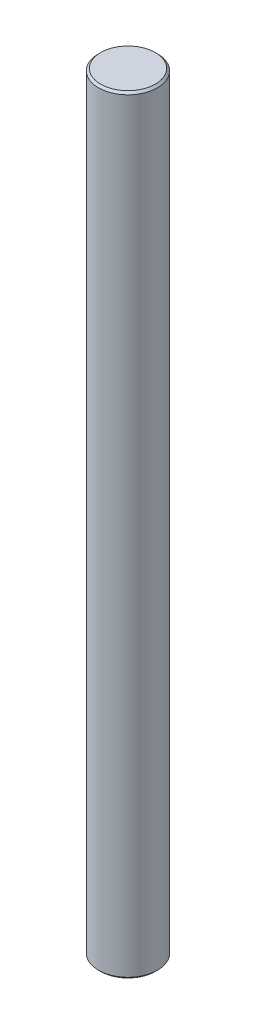
ISO-10303-21;
HEADER;
FILE_DESCRIPTION(('STEP AP214'),'2;1');
FILE_NAME('part.step','',(''),(''),'','','');
FILE_SCHEMA(('AUTOMOTIVE_DESIGN { 1 0 10303 214 1 1 1 1 }'));
ENDSEC;
DATA;
#1=APPLICATION_CONTEXT('core data for automotive mechanical design processes');
#2=APPLICATION_PROTOCOL_DEFINITION('international standard','automotive_design',2000,#1);
#3=PRODUCT_CONTEXT('',#1,'mechanical');
#4=PRODUCT('Part','Part','',(#3));
#5=PRODUCT_RELATED_PRODUCT_CATEGORY('part','',(#4));
#6=PRODUCT_DEFINITION_FORMATION('','',#4);
#7=PRODUCT_DEFINITION_CONTEXT('part definition',#1,'design');
#8=PRODUCT_DEFINITION('design','',#6,#7);
#9=PRODUCT_DEFINITION_SHAPE('','',#8);
#10=(LENGTH_UNIT() NAMED_UNIT(*) SI_UNIT(.MILLI.,.METRE.));
#11=(NAMED_UNIT(*) PLANE_ANGLE_UNIT() SI_UNIT($,.RADIAN.));
#12=(NAMED_UNIT(*) SI_UNIT($,.STERADIAN.) SOLID_ANGLE_UNIT());
#13=UNCERTAINTY_MEASURE_WITH_UNIT(LENGTH_MEASURE(1.E-05),#10,'distance_accuracy_value','');
#14=(GEOMETRIC_REPRESENTATION_CONTEXT(3) GLOBAL_UNCERTAINTY_ASSIGNED_CONTEXT((#13)) GLOBAL_UNIT_ASSIGNED_CONTEXT((#10,
#11,#12)) REPRESENTATION_CONTEXT('',''));
#15=CARTESIAN_POINT('',(0.,0.,0.));
#16=DIRECTION('',(0.,0.,1.));
#17=DIRECTION('',(1.,0.,0.));
#18=AXIS2_PLACEMENT_3D('',#15,#16,#17);
#19=CARTESIAN_POINT('',(0.,182.5,0.));
#20=DIRECTION('',(0.,-1.,0.));
#21=DIRECTION('',(0.,0.,-1.));
#22=AXIS2_PLACEMENT_3D('',#19,#20,#21);
#23=CYLINDRICAL_SURFACE('',#22,13.9999999999993);
#24=CARTESIAN_POINT('',(0.,-181.5,0.));
#25=DIRECTION('',(0.,1.,0.));
#26=DIRECTION('',(0.,0.,1.));
#27=AXIS2_PLACEMENT_3D('',#24,#25,#26);
#28=CIRCLE('',#27,13.9999999999993);
#29=CARTESIAN_POINT('',(0.,-181.5,13.9999999999993));
#30=VERTEX_POINT('',#29);
#31=EDGE_CURVE('E50',#30,#30,#28,.T.);
#32=ORIENTED_EDGE('',*,*,#31,.T.);
#33=EDGE_LOOP('',(#32));
#34=FACE_BOUND('',#33,.T.);
#35=CARTESIAN_POINT('',(0.,181.5,0.));
#36=DIRECTION('',(0.,1.,0.));
#37=DIRECTION('',(0.,0.,1.));
#38=AXIS2_PLACEMENT_3D('',#35,#36,#37);
#39=CIRCLE('',#38,13.9999999999993);
#40=CARTESIAN_POINT('',(0.,181.5,13.9999999999993));
#41=VERTEX_POINT('',#40);
#42=EDGE_CURVE('E55',#41,#41,#39,.F.);
#43=ORIENTED_EDGE('',*,*,#42,.T.);
#44=EDGE_LOOP('',(#43));
#45=FACE_BOUND('',#44,.T.);
#46=ADVANCED_FACE('F37',(#34,#45),#23,.T.);
#47=CARTESIAN_POINT('',(0.,182.5,0.));
#48=DIRECTION('',(0.,1.,0.));
#49=DIRECTION('',(0.,0.,1.));
#50=AXIS2_PLACEMENT_3D('',#47,#48,#49);
#51=PLANE('',#50);
#52=CARTESIAN_POINT('',(0.,182.5,0.));
#53=DIRECTION('',(0.,1.,0.));
#54=DIRECTION('',(0.,0.,1.));
#55=AXIS2_PLACEMENT_3D('',#52,#53,#54);
#56=CIRCLE('',#55,12.9999999999995);
#57=CARTESIAN_POINT('',(0.,182.5,12.9999999999995));
#58=VERTEX_POINT('',#57);
#59=EDGE_CURVE('E10',#58,#58,#56,.T.);
#60=ORIENTED_EDGE('',*,*,#59,.T.);
#61=EDGE_LOOP('',(#60));
#62=FACE_BOUND('',#61,.T.);
#63=ADVANCED_FACE('F72',(#62),#51,.T.);
#64=CARTESIAN_POINT('',(0.,-182.5,0.));
#65=DIRECTION('',(0.,1.,0.));
#66=DIRECTION('',(0.,0.,1.));
#67=AXIS2_PLACEMENT_3D('',#64,#65,#66);
#68=PLANE('',#67);
#69=CARTESIAN_POINT('',(0.,-182.5,0.));
#70=DIRECTION('',(0.,1.,0.));
#71=DIRECTION('',(0.,0.,1.));
#72=AXIS2_PLACEMENT_3D('',#69,#70,#71);
#73=CIRCLE('',#72,12.999999999999);
#74=CARTESIAN_POINT('',(0.,-182.5,12.999999999999));
#75=VERTEX_POINT('',#74);
#76=EDGE_CURVE('E45',#75,#75,#73,.F.);
#77=ORIENTED_EDGE('',*,*,#76,.T.);
#78=EDGE_LOOP('',(#77));
#79=FACE_BOUND('',#78,.T.);
#80=ADVANCED_FACE('F69',(#79),#68,.F.);
#81=CARTESIAN_POINT('',(0.,-181.5,0.));
#82=DIRECTION('',(0.,1.,0.));
#83=DIRECTION('',(0.,0.,1.));
#84=AXIS2_PLACEMENT_3D('',#81,#82,#83);
#85=CONICAL_SURFACE('',#84,13.9999999999993,0.785398163397435);
#86=ORIENTED_EDGE('',*,*,#76,.F.);
#87=EDGE_LOOP('',(#86));
#88=FACE_BOUND('',#87,.T.);
#89=ORIENTED_EDGE('',*,*,#31,.F.);
#90=EDGE_LOOP('',(#89));
#91=FACE_BOUND('',#90,.T.);
#92=ADVANCED_FACE('F65',(#88,#91),#85,.T.);
#93=CARTESIAN_POINT('',(0.,182.5,0.));
#94=DIRECTION('',(0.,-1.,0.));
#95=DIRECTION('',(0.,0.,-1.));
#96=AXIS2_PLACEMENT_3D('',#93,#94,#95);
#97=CONICAL_SURFACE('',#96,12.9999999999995,0.785398163397449);
#98=ORIENTED_EDGE('',*,*,#42,.F.);
#99=EDGE_LOOP('',(#98));
#100=FACE_BOUND('',#99,.T.);
#101=ORIENTED_EDGE('',*,*,#59,.F.);
#102=EDGE_LOOP('',(#101));
#103=FACE_BOUND('',#102,.T.);
#104=ADVANCED_FACE('F39',(#100,#103),#97,.T.);
#105=CLOSED_SHELL('',(#46,#63,#80,#92,#104));
#106=MANIFOLD_SOLID_BREP('B2',#105);
#107=ADVANCED_BREP_SHAPE_REPRESENTATION('',(#18,#106),#14);
#108=SHAPE_DEFINITION_REPRESENTATION(#9,#107);
ENDSEC;
END-ISO-10303-21;
